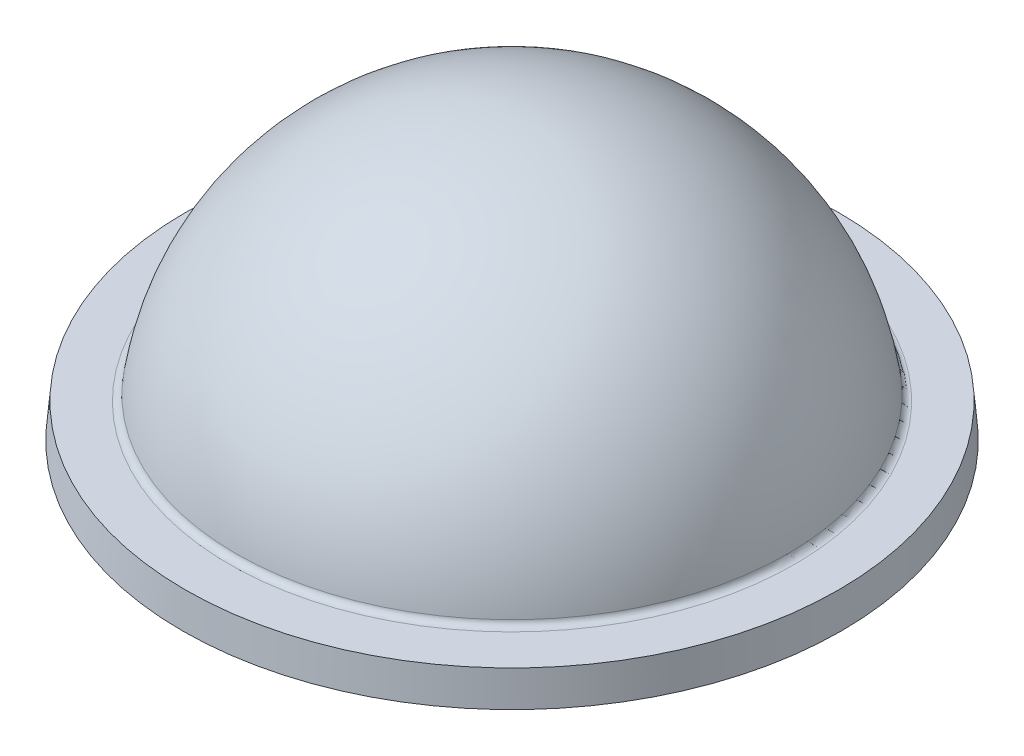
ISO-10303-21;
HEADER;
FILE_DESCRIPTION(('STEP AP214'),'2;1');
FILE_NAME('part.step','',(''),(''),'','','');
FILE_SCHEMA(('AUTOMOTIVE_DESIGN { 1 0 10303 214 1 1 1 1 }'));
ENDSEC;
DATA;
#1=APPLICATION_CONTEXT('core data for automotive mechanical design processes');
#2=APPLICATION_PROTOCOL_DEFINITION('international standard','automotive_design',2000,#1);
#3=PRODUCT_CONTEXT('',#1,'mechanical');
#4=PRODUCT('Part','Part','',(#3));
#5=PRODUCT_RELATED_PRODUCT_CATEGORY('part','',(#4));
#6=PRODUCT_DEFINITION_FORMATION('','',#4);
#7=PRODUCT_DEFINITION_CONTEXT('part definition',#1,'design');
#8=PRODUCT_DEFINITION('design','',#6,#7);
#9=PRODUCT_DEFINITION_SHAPE('','',#8);
#10=(LENGTH_UNIT() NAMED_UNIT(*) SI_UNIT(.MILLI.,.METRE.));
#11=(NAMED_UNIT(*) PLANE_ANGLE_UNIT() SI_UNIT($,.RADIAN.));
#12=(NAMED_UNIT(*) SI_UNIT($,.STERADIAN.) SOLID_ANGLE_UNIT());
#13=UNCERTAINTY_MEASURE_WITH_UNIT(LENGTH_MEASURE(1.E-05),#10,'distance_accuracy_value','');
#14=(GEOMETRIC_REPRESENTATION_CONTEXT(3) GLOBAL_UNCERTAINTY_ASSIGNED_CONTEXT((#13)) GLOBAL_UNIT_ASSIGNED_CONTEXT((#10,
#11,#12)) REPRESENTATION_CONTEXT('',''));
#15=CARTESIAN_POINT('',(0.,0.,0.));
#16=DIRECTION('',(0.,0.,1.));
#17=DIRECTION('',(1.,0.,0.));
#18=AXIS2_PLACEMENT_3D('',#15,#16,#17);
#19=CARTESIAN_POINT('',(0.,0.,0.));
#20=DIRECTION('',(0.,1.,0.));
#21=DIRECTION('',(-1.,0.,0.));
#22=AXIS2_PLACEMENT_3D('',#19,#20,#21);
#23=SPHERICAL_SURFACE('',#22,18.);
#24=CARTESIAN_POINT('',(0.,0.947368421052632,0.));
#25=DIRECTION('',(0.,-1.,0.));
#26=DIRECTION('',(0.,0.,-1.));
#27=AXIS2_PLACEMENT_3D('',#24,#25,#26);
#28=CIRCLE('',#27,17.9750519630624);
#29=CARTESIAN_POINT('',(0.,0.947368421052632,-17.9750519630624));
#30=VERTEX_POINT('',#29);
#31=EDGE_CURVE('E10',#30,#30,#28,.T.);
#32=ORIENTED_EDGE('',*,*,#31,.T.);
#33=EDGE_LOOP('',(#32));
#34=FACE_BOUND('',#33,.T.);
#35=ADVANCED_FACE('F43',(#34),#23,.F.);
#36=CARTESIAN_POINT('',(18.,0.,0.));
#37=DIRECTION('',(0.,1.,0.));
#38=DIRECTION('',(0.,0.,1.));
#39=AXIS2_PLACEMENT_3D('',#36,#37,#38);
#40=PLANE('',#39);
#41=CARTESIAN_POINT('',(0.,0.,0.));
#42=DIRECTION('',(0.,1.,0.));
#43=DIRECTION('',(0.,0.,1.));
#44=AXIS2_PLACEMENT_3D('',#41,#42,#43);
#45=CIRCLE('',#44,18.9736659610103);
#46=CARTESIAN_POINT('',(0.,0.,18.9736659610103));
#47=VERTEX_POINT('',#46);
#48=EDGE_CURVE('E51',#47,#47,#45,.T.);
#49=ORIENTED_EDGE('',*,*,#48,.T.);
#50=EDGE_LOOP('',(#49));
#51=FACE_BOUND('',#50,.T.);
#52=CARTESIAN_POINT('',(0.,0.,0.));
#53=DIRECTION('',(0.,1.,0.));
#54=DIRECTION('',(0.,0.,1.));
#55=AXIS2_PLACEMENT_3D('',#52,#53,#54);
#56=CIRCLE('',#55,24.25);
#57=CARTESIAN_POINT('',(0.,0.,24.25));
#58=VERTEX_POINT('',#57);
#59=EDGE_CURVE('E69',#58,#58,#56,.T.);
#60=ORIENTED_EDGE('',*,*,#59,.F.);
#61=EDGE_LOOP('',(#60));
#62=FACE_BOUND('',#61,.T.);
#63=ADVANCED_FACE('F84',(#51,#62),#40,.F.);
#64=CARTESIAN_POINT('',(0.,0.,0.));
#65=DIRECTION('',(0.,-1.,0.));
#66=DIRECTION('',(0.,0.,-1.));
#67=AXIS2_PLACEMENT_3D('',#64,#65,#66);
#68=CONICAL_SURFACE('',#67,24.25,0.0872664625997095);
#69=CARTESIAN_POINT('',(0.,2.5,0.));
#70=DIRECTION('',(0.,1.,0.));
#71=DIRECTION('',(0.,0.,1.));
#72=AXIS2_PLACEMENT_3D('',#69,#70,#71);
#73=CIRCLE('',#72,24.0312783411852);
#74=CARTESIAN_POINT('',(0.,2.5,24.0312783411852));
#75=VERTEX_POINT('',#74);
#76=EDGE_CURVE('E73',#75,#75,#73,.T.);
#77=ORIENTED_EDGE('',*,*,#76,.F.);
#78=EDGE_LOOP('',(#77));
#79=FACE_BOUND('',#78,.T.);
#80=ORIENTED_EDGE('',*,*,#59,.T.);
#81=EDGE_LOOP('',(#80));
#82=FACE_BOUND('',#81,.T.);
#83=ADVANCED_FACE('F81',(#79,#82),#68,.T.);
#84=CARTESIAN_POINT('',(24.0312783411852,2.5,0.));
#85=DIRECTION('',(0.,-1.,0.));
#86=DIRECTION('',(0.,0.,-1.));
#87=AXIS2_PLACEMENT_3D('',#84,#85,#86);
#88=PLANE('',#87);
#89=CARTESIAN_POINT('',(0.,2.5,0.));
#90=DIRECTION('',(0.,-1.,0.));
#91=DIRECTION('',(0.,0.,-1.));
#92=AXIS2_PLACEMENT_3D('',#89,#90,#91);
#93=CIRCLE('',#92,20.7846096908265);
#94=CARTESIAN_POINT('',(0.,2.5,-20.7846096908265));
#95=VERTEX_POINT('',#94);
#96=EDGE_CURVE('E57',#95,#95,#93,.T.);
#97=ORIENTED_EDGE('',*,*,#96,.T.);
#98=EDGE_LOOP('',(#97));
#99=FACE_BOUND('',#98,.T.);
#100=ORIENTED_EDGE('',*,*,#76,.T.);
#101=EDGE_LOOP('',(#100));
#102=FACE_BOUND('',#101,.T.);
#103=ADVANCED_FACE('F79',(#99,#102),#88,.F.);
#104=CARTESIAN_POINT('',(0.,0.,0.));
#105=DIRECTION('',(0.,1.,0.));
#106=DIRECTION('',(1.,0.,0.));
#107=AXIS2_PLACEMENT_3D('',#104,#105,#106);
#108=SPHERICAL_SURFACE('',#107,20.5);
#109=CARTESIAN_POINT('',(0.,2.92857142857143,0.));
#110=DIRECTION('',(0.,-1.,0.));
#111=DIRECTION('',(0.,0.,-1.));
#112=AXIS2_PLACEMENT_3D('',#109,#110,#111);
#113=CIRCLE('',#112,20.2897380315211);
#114=CARTESIAN_POINT('',(0.,2.92857142857143,-20.2897380315211));
#115=VERTEX_POINT('',#114);
#116=EDGE_CURVE('E63',#115,#115,#113,.F.);
#117=ORIENTED_EDGE('',*,*,#116,.T.);
#118=EDGE_LOOP('',(#117));
#119=FACE_BOUND('',#118,.T.);
#120=ADVANCED_FACE('F97',(#119),#108,.T.);
#121=CARTESIAN_POINT('',(0.,3.,0.));
#122=DIRECTION('',(0.,-1.,0.));
#123=DIRECTION('',(0.,0.,-1.));
#124=AXIS2_PLACEMENT_3D('',#121,#122,#123);
#125=TOROIDAL_SURFACE('',#124,20.7846096908265,0.5);
#126=ORIENTED_EDGE('',*,*,#96,.F.);
#127=EDGE_LOOP('',(#126));
#128=FACE_BOUND('',#127,.T.);
#129=ORIENTED_EDGE('',*,*,#116,.F.);
#130=EDGE_LOOP('',(#129));
#131=FACE_BOUND('',#130,.T.);
#132=ADVANCED_FACE('F95',(#128,#131),#125,.F.);
#133=CARTESIAN_POINT('',(0.,1.,0.));
#134=DIRECTION('',(0.,1.,0.));
#135=DIRECTION('',(0.,0.,1.));
#136=AXIS2_PLACEMENT_3D('',#133,#134,#135);
#137=TOROIDAL_SURFACE('',#136,18.9736659610103,1.);
#138=ORIENTED_EDGE('',*,*,#31,.F.);
#139=EDGE_LOOP('',(#138));
#140=FACE_BOUND('',#139,.T.);
#141=ORIENTED_EDGE('',*,*,#48,.F.);
#142=EDGE_LOOP('',(#141));
#143=FACE_BOUND('',#142,.T.);
#144=ADVANCED_FACE('F45',(#140,#143),#137,.T.);
#145=CLOSED_SHELL('',(#35,#63,#83,#103,#120,#132,#144));
#146=MANIFOLD_SOLID_BREP('B2',#145);
#147=ADVANCED_BREP_SHAPE_REPRESENTATION('',(#18,#146),#14);
#148=SHAPE_DEFINITION_REPRESENTATION(#9,#147);
ENDSEC;
END-ISO-10303-21;
